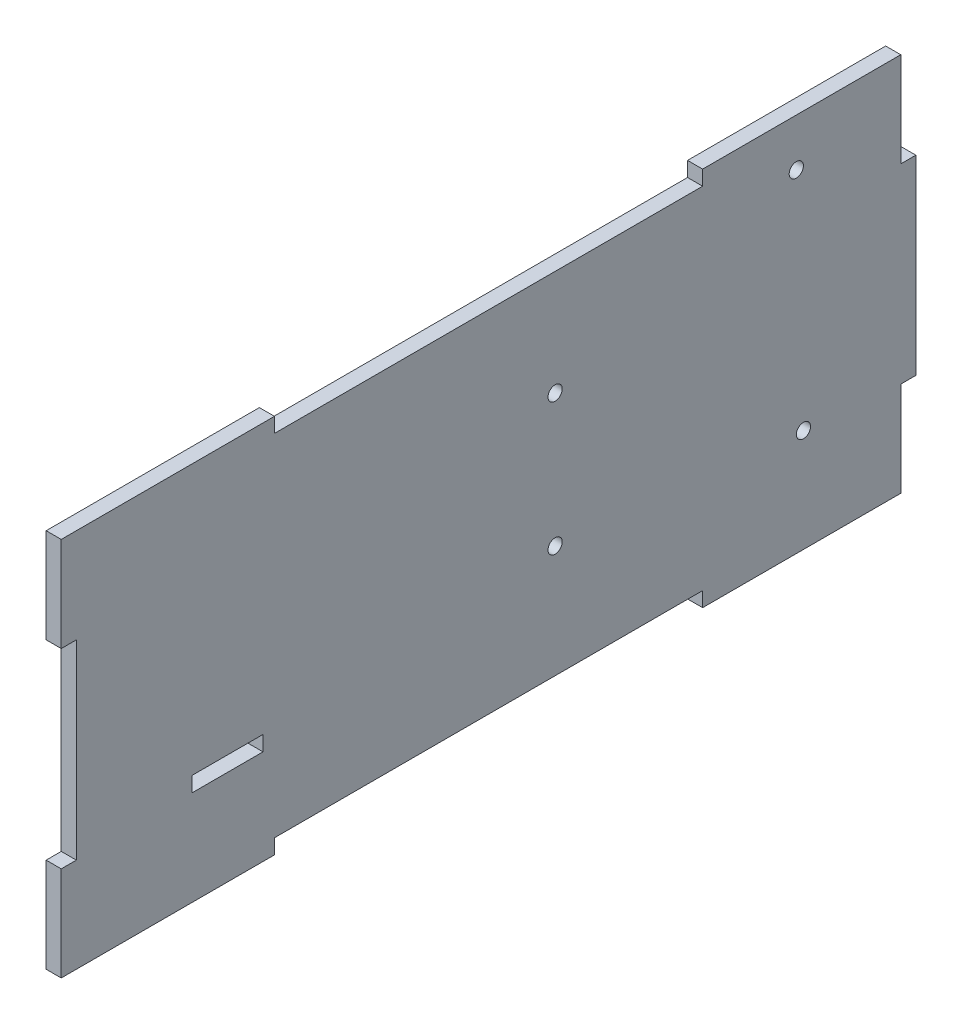
ISO-10303-21;
HEADER;
FILE_DESCRIPTION(('STEP AP214'),'2;1');
FILE_NAME('part.step','',(''),(''),'','','');
FILE_SCHEMA(('AUTOMOTIVE_DESIGN { 1 0 10303 214 1 1 1 1 }'));
ENDSEC;
DATA;
#1=APPLICATION_CONTEXT('core data for automotive mechanical design processes');
#2=APPLICATION_PROTOCOL_DEFINITION('international standard','automotive_design',2000,#1);
#3=PRODUCT_CONTEXT('',#1,'mechanical');
#4=PRODUCT('Part','Part','',(#3));
#5=PRODUCT_RELATED_PRODUCT_CATEGORY('part','',(#4));
#6=PRODUCT_DEFINITION_FORMATION('','',#4);
#7=PRODUCT_DEFINITION_CONTEXT('part definition',#1,'design');
#8=PRODUCT_DEFINITION('design','',#6,#7);
#9=PRODUCT_DEFINITION_SHAPE('','',#8);
#10=(LENGTH_UNIT() NAMED_UNIT(*) SI_UNIT(.MILLI.,.METRE.));
#11=(NAMED_UNIT(*) PLANE_ANGLE_UNIT() SI_UNIT($,.RADIAN.));
#12=(NAMED_UNIT(*) SI_UNIT($,.STERADIAN.) SOLID_ANGLE_UNIT());
#13=UNCERTAINTY_MEASURE_WITH_UNIT(LENGTH_MEASURE(1.E-05),#10,'distance_accuracy_value','');
#14=(GEOMETRIC_REPRESENTATION_CONTEXT(3) GLOBAL_UNCERTAINTY_ASSIGNED_CONTEXT((#13)) GLOBAL_UNIT_ASSIGNED_CONTEXT((#10,
#11,#12)) REPRESENTATION_CONTEXT('',''));
#15=CARTESIAN_POINT('',(0.,0.,0.));
#16=DIRECTION('',(0.,0.,1.));
#17=DIRECTION('',(1.,0.,0.));
#18=AXIS2_PLACEMENT_3D('',#15,#16,#17);
#19=CARTESIAN_POINT('',(3.18,-40.,-90.));
#20=DIRECTION('',(0.,1.,0.));
#21=DIRECTION('',(0.,0.,1.));
#22=AXIS2_PLACEMENT_3D('',#19,#20,#21);
#23=PLANE('',#22);
#24=DIRECTION('',(1.,0.,0.));
#25=VECTOR('',#24,1.);
#26=CARTESIAN_POINT('',(-20.162353533256,-40.,-86.82));
#27=LINE('',#26,#25);
#28=CARTESIAN_POINT('',(0.,-40.,-86.82));
#29=VERTEX_POINT('',#28);
#30=CARTESIAN_POINT('',(3.18,-40.,-86.82));
#31=VERTEX_POINT('',#30);
#32=EDGE_CURVE('E270',#29,#31,#27,.T.);
#33=ORIENTED_EDGE('',*,*,#32,.T.);
#34=DIRECTION('',(0.,0.,-1.));
#35=VECTOR('',#34,1.);
#36=CARTESIAN_POINT('',(3.18,-40.,-90.));
#37=LINE('',#36,#35);
#38=CARTESIAN_POINT('',(3.18,-40.,-45.09));
#39=VERTEX_POINT('',#38);
#40=EDGE_CURVE('E374',#39,#31,#37,.T.);
#41=ORIENTED_EDGE('',*,*,#40,.F.);
#42=DIRECTION('',(1.,0.,0.));
#43=VECTOR('',#42,1.);
#44=CARTESIAN_POINT('',(-90.2339559146112,-40.,-45.09));
#45=LINE('',#44,#43);
#46=CARTESIAN_POINT('',(0.,-40.,-45.09));
#47=VERTEX_POINT('',#46);
#48=EDGE_CURVE('E318',#47,#39,#45,.T.);
#49=ORIENTED_EDGE('',*,*,#48,.F.);
#50=DIRECTION('',(0.,0.,-1.));
#51=VECTOR('',#50,1.);
#52=CARTESIAN_POINT('',(0.,-40.,-90.));
#53=LINE('',#52,#51);
#54=EDGE_CURVE('E387',#47,#29,#53,.T.);
#55=ORIENTED_EDGE('',*,*,#54,.T.);
#56=EDGE_LOOP('',(#33,#41,#49,#55));
#57=FACE_BOUND('',#56,.T.);
#58=ADVANCED_FACE('F37',(#57),#23,.F.);
#59=CARTESIAN_POINT('',(3.18,0.,0.));
#60=DIRECTION('',(1.,0.,0.));
#61=DIRECTION('',(0.,0.,-1.));
#62=AXIS2_PLACEMENT_3D('',#59,#60,#61);
#63=PLANE('',#62);
#64=DIRECTION('',(0.,1.,0.));
#65=VECTOR('',#64,1.);
#66=CARTESIAN_POINT('',(3.18,-16.82,62.5));
#67=LINE('',#66,#65);
#68=CARTESIAN_POINT('',(3.18,-20.,62.5));
#69=VERTEX_POINT('',#68);
#70=CARTESIAN_POINT('',(3.18,-16.82,62.5));
#71=VERTEX_POINT('',#70);
#72=EDGE_CURVE('E200',#69,#71,#67,.T.);
#73=ORIENTED_EDGE('',*,*,#72,.T.);
#74=DIRECTION('',(0.,0.,-1.));
#75=VECTOR('',#74,1.);
#76=CARTESIAN_POINT('',(3.18,-16.82,62.5));
#77=LINE('',#76,#75);
#78=CARTESIAN_POINT('',(3.18,-16.82,47.5));
#79=VERTEX_POINT('',#78);
#80=EDGE_CURVE('E209',#71,#79,#77,.T.);
#81=ORIENTED_EDGE('',*,*,#80,.T.);
#82=DIRECTION('',(0.,-1.,0.));
#83=VECTOR('',#82,1.);
#84=CARTESIAN_POINT('',(3.18,-16.82,47.5));
#85=LINE('',#84,#83);
#86=CARTESIAN_POINT('',(3.18,-20.,47.5));
#87=VERTEX_POINT('',#86);
#88=EDGE_CURVE('E52',#79,#87,#85,.T.);
#89=ORIENTED_EDGE('',*,*,#88,.T.);
#90=DIRECTION('',(0.,0.,1.));
#91=VECTOR('',#90,1.);
#92=CARTESIAN_POINT('',(3.18,-20.,62.5));
#93=LINE('',#92,#91);
#94=EDGE_CURVE('E206',#87,#69,#93,.T.);
#95=ORIENTED_EDGE('',*,*,#94,.T.);
#96=EDGE_LOOP('',(#73,#81,#89,#95));
#97=FACE_BOUND('',#96,.T.);
#98=CARTESIAN_POINT('',(3.18,30.,-64.82));
#99=DIRECTION('',(1.,0.,0.));
#100=DIRECTION('',(0.,0.,-1.));
#101=AXIS2_PLACEMENT_3D('',#98,#99,#100);
#102=CIRCLE('',#101,1.5);
#103=CARTESIAN_POINT('',(3.18,30.,-66.32));
#104=VERTEX_POINT('',#103);
#105=EDGE_CURVE('E235',#104,#104,#102,.T.);
#106=ORIENTED_EDGE('',*,*,#105,.F.);
#107=EDGE_LOOP('',(#106));
#108=FACE_BOUND('',#107,.T.);
#109=CARTESIAN_POINT('',(3.18,14.7,-14.02));
#110=DIRECTION('',(1.,0.,0.));
#111=DIRECTION('',(0.,0.,-1.));
#112=AXIS2_PLACEMENT_3D('',#109,#110,#111);
#113=CIRCLE('',#112,1.49999999999997);
#114=CARTESIAN_POINT('',(3.18,14.7,-15.52));
#115=VERTEX_POINT('',#114);
#116=EDGE_CURVE('E243',#115,#115,#113,.T.);
#117=ORIENTED_EDGE('',*,*,#116,.F.);
#118=EDGE_LOOP('',(#117));
#119=FACE_BOUND('',#118,.T.);
#120=CARTESIAN_POINT('',(3.18,-13.2,-14.02));
#121=DIRECTION('',(1.,0.,0.));
#122=DIRECTION('',(0.,0.,-1.));
#123=AXIS2_PLACEMENT_3D('',#120,#121,#122);
#124=CIRCLE('',#123,1.49999999999997);
#125=CARTESIAN_POINT('',(3.18,-13.2,-15.52));
#126=VERTEX_POINT('',#125);
#127=EDGE_CURVE('E249',#126,#126,#124,.T.);
#128=ORIENTED_EDGE('',*,*,#127,.F.);
#129=EDGE_LOOP('',(#128));
#130=FACE_BOUND('',#129,.T.);
#131=CARTESIAN_POINT('',(3.18,-18.3,-66.32));
#132=DIRECTION('',(1.,0.,0.));
#133=DIRECTION('',(0.,0.,-1.));
#134=AXIS2_PLACEMENT_3D('',#131,#132,#133);
#135=CIRCLE('',#134,1.49999999999998);
#136=CARTESIAN_POINT('',(3.18,-18.3,-67.82));
#137=VERTEX_POINT('',#136);
#138=EDGE_CURVE('E231',#137,#137,#135,.T.);
#139=ORIENTED_EDGE('',*,*,#138,.F.);
#140=EDGE_LOOP('',(#139));
#141=FACE_BOUND('',#140,.T.);
#142=DIRECTION('',(0.,1.,0.));
#143=VECTOR('',#142,1.);
#144=CARTESIAN_POINT('',(3.18,-40.,-86.82));
#145=LINE('',#144,#143);
#146=CARTESIAN_POINT('',(3.18,-20.09,-86.82));
#147=VERTEX_POINT('',#146);
#148=EDGE_CURVE('E266',#31,#147,#145,.T.);
#149=ORIENTED_EDGE('',*,*,#148,.T.);
#150=DIRECTION('',(0.,0.,-1.));
#151=VECTOR('',#150,1.);
#152=CARTESIAN_POINT('',(3.18,-20.09,-90.));
#153=LINE('',#152,#151);
#154=CARTESIAN_POINT('',(3.18,-20.09,-90.));
#155=VERTEX_POINT('',#154);
#156=EDGE_CURVE('E242',#147,#155,#153,.T.);
#157=ORIENTED_EDGE('',*,*,#156,.T.);
#158=DIRECTION('',(0.,1.,0.));
#159=VECTOR('',#158,1.);
#160=CARTESIAN_POINT('',(3.18,-40.,-90.));
#161=LINE('',#160,#159);
#162=CARTESIAN_POINT('',(3.18,20.09,-90.));
#163=VERTEX_POINT('',#162);
#164=EDGE_CURVE('E379',#155,#163,#161,.T.);
#165=ORIENTED_EDGE('',*,*,#164,.T.);
#166=DIRECTION('',(0.,0.,-1.));
#167=VECTOR('',#166,1.);
#168=CARTESIAN_POINT('',(3.18,20.09,-90.));
#169=LINE('',#168,#167);
#170=CARTESIAN_POINT('',(3.18,20.09,-86.82));
#171=VERTEX_POINT('',#170);
#172=EDGE_CURVE('E286',#171,#163,#169,.T.);
#173=ORIENTED_EDGE('',*,*,#172,.F.);
#174=DIRECTION('',(0.,-1.,0.));
#175=VECTOR('',#174,1.);
#176=CARTESIAN_POINT('',(3.18,40.,-86.82));
#177=LINE('',#176,#175);
#178=CARTESIAN_POINT('',(3.18,40.,-86.82));
#179=VERTEX_POINT('',#178);
#180=EDGE_CURVE('E262',#179,#171,#177,.T.);
#181=ORIENTED_EDGE('',*,*,#180,.F.);
#182=DIRECTION('',(0.,0.,1.));
#183=VECTOR('',#182,1.);
#184=CARTESIAN_POINT('',(3.18,40.,-90.));
#185=LINE('',#184,#183);
#186=CARTESIAN_POINT('',(3.18,40.,-45.09));
#187=VERTEX_POINT('',#186);
#188=EDGE_CURVE('E382',#179,#187,#185,.T.);
#189=ORIENTED_EDGE('',*,*,#188,.T.);
#190=DIRECTION('',(0.,1.,0.));
#191=VECTOR('',#190,1.);
#192=CARTESIAN_POINT('',(3.18,40.,-45.09));
#193=LINE('',#192,#191);
#194=CARTESIAN_POINT('',(3.18,36.88,-45.09));
#195=VERTEX_POINT('',#194);
#196=EDGE_CURVE('E334',#195,#187,#193,.T.);
#197=ORIENTED_EDGE('',*,*,#196,.F.);
#198=DIRECTION('',(0.,0.,-1.));
#199=VECTOR('',#198,1.);
#200=CARTESIAN_POINT('',(3.18,36.88,45.09));
#201=LINE('',#200,#199);
#202=CARTESIAN_POINT('',(3.18,36.88,45.09));
#203=VERTEX_POINT('',#202);
#204=EDGE_CURVE('E331',#203,#195,#201,.T.);
#205=ORIENTED_EDGE('',*,*,#204,.F.);
#206=DIRECTION('',(0.,-1.,0.));
#207=VECTOR('',#206,1.);
#208=CARTESIAN_POINT('',(3.18,40.,45.09));
#209=LINE('',#208,#207);
#210=CARTESIAN_POINT('',(3.18,40.,45.09));
#211=VERTEX_POINT('',#210);
#212=EDGE_CURVE('E305',#211,#203,#209,.T.);
#213=ORIENTED_EDGE('',*,*,#212,.F.);
#214=CARTESIAN_POINT('',(3.18,40.,90.));
#215=VERTEX_POINT('',#214);
#216=EDGE_CURVE('E381',#211,#215,#185,.T.);
#217=ORIENTED_EDGE('',*,*,#216,.T.);
#218=DIRECTION('',(0.,-1.,0.));
#219=VECTOR('',#218,1.);
#220=CARTESIAN_POINT('',(3.18,-40.,90.));
#221=LINE('',#220,#219);
#222=CARTESIAN_POINT('',(3.18,20.09,90.));
#223=VERTEX_POINT('',#222);
#224=EDGE_CURVE('E371',#215,#223,#221,.T.);
#225=ORIENTED_EDGE('',*,*,#224,.T.);
#226=DIRECTION('',(0.,0.,1.));
#227=VECTOR('',#226,1.);
#228=CARTESIAN_POINT('',(3.18,20.09,90.));
#229=LINE('',#228,#227);
#230=CARTESIAN_POINT('',(3.18,20.09,86.82));
#231=VERTEX_POINT('',#230);
#232=EDGE_CURVE('E359',#231,#223,#229,.T.);
#233=ORIENTED_EDGE('',*,*,#232,.F.);
#234=DIRECTION('',(0.,1.,0.));
#235=VECTOR('',#234,1.);
#236=CARTESIAN_POINT('',(3.18,-20.09,86.82));
#237=LINE('',#236,#235);
#238=CARTESIAN_POINT('',(3.18,-20.09,86.82));
#239=VERTEX_POINT('',#238);
#240=EDGE_CURVE('E356',#239,#231,#237,.T.);
#241=ORIENTED_EDGE('',*,*,#240,.F.);
#242=DIRECTION('',(0.,0.,-1.));
#243=VECTOR('',#242,1.);
#244=CARTESIAN_POINT('',(3.18,-20.09,90.));
#245=LINE('',#244,#243);
#246=CARTESIAN_POINT('',(3.18,-20.09,90.));
#247=VERTEX_POINT('',#246);
#248=EDGE_CURVE('E346',#247,#239,#245,.T.);
#249=ORIENTED_EDGE('',*,*,#248,.F.);
#250=CARTESIAN_POINT('',(3.18,-40.,90.));
#251=VERTEX_POINT('',#250);
#252=EDGE_CURVE('E375',#247,#251,#221,.T.);
#253=ORIENTED_EDGE('',*,*,#252,.T.);
#254=CARTESIAN_POINT('',(3.18,-40.,45.09));
#255=VERTEX_POINT('',#254);
#256=EDGE_CURVE('E376',#251,#255,#37,.T.);
#257=ORIENTED_EDGE('',*,*,#256,.T.);
#258=DIRECTION('',(0.,1.,0.));
#259=VECTOR('',#258,1.);
#260=CARTESIAN_POINT('',(3.18,-40.,45.09));
#261=LINE('',#260,#259);
#262=CARTESIAN_POINT('',(3.18,-36.88,45.09));
#263=VERTEX_POINT('',#262);
#264=EDGE_CURVE('E283',#255,#263,#261,.T.);
#265=ORIENTED_EDGE('',*,*,#264,.T.);
#266=DIRECTION('',(0.,0.,-1.));
#267=VECTOR('',#266,1.);
#268=CARTESIAN_POINT('',(3.18,-36.88,45.09));
#269=LINE('',#268,#267);
#270=CARTESIAN_POINT('',(3.18,-36.88,-45.09));
#271=VERTEX_POINT('',#270);
#272=EDGE_CURVE('E311',#263,#271,#269,.T.);
#273=ORIENTED_EDGE('',*,*,#272,.T.);
#274=DIRECTION('',(0.,-1.,0.));
#275=VECTOR('',#274,1.);
#276=CARTESIAN_POINT('',(3.18,-40.,-45.09));
#277=LINE('',#276,#275);
#278=EDGE_CURVE('E308',#271,#39,#277,.T.);
#279=ORIENTED_EDGE('',*,*,#278,.T.);
#280=ORIENTED_EDGE('',*,*,#40,.T.);
#281=EDGE_LOOP('',(#149,#157,#165,#173,#181,#189,#197,#205,#213,#217,#225,#233,#241,#249,#253,
#257,#265,#273,#279,#280));
#282=FACE_BOUND('',#281,.T.);
#283=ADVANCED_FACE('F213',(#97,#108,#119,#130,#141,#282),#63,.T.);
#284=CARTESIAN_POINT('',(0.,0.,0.));
#285=DIRECTION('',(1.,0.,0.));
#286=DIRECTION('',(0.,0.,-1.));
#287=AXIS2_PLACEMENT_3D('',#284,#285,#286);
#288=PLANE('',#287);
#289=DIRECTION('',(0.,0.,-1.));
#290=VECTOR('',#289,1.);
#291=CARTESIAN_POINT('',(0.,-16.82,62.5));
#292=LINE('',#291,#290);
#293=CARTESIAN_POINT('',(0.,-16.82,62.5));
#294=VERTEX_POINT('',#293);
#295=CARTESIAN_POINT('',(0.,-16.82,47.5));
#296=VERTEX_POINT('',#295);
#297=EDGE_CURVE('E225',#294,#296,#292,.T.);
#298=ORIENTED_EDGE('',*,*,#297,.F.);
#299=DIRECTION('',(0.,1.,0.));
#300=VECTOR('',#299,1.);
#301=CARTESIAN_POINT('',(0.,-16.82,62.5));
#302=LINE('',#301,#300);
#303=CARTESIAN_POINT('',(0.,-20.,62.5));
#304=VERTEX_POINT('',#303);
#305=EDGE_CURVE('E60',#304,#294,#302,.T.);
#306=ORIENTED_EDGE('',*,*,#305,.F.);
#307=DIRECTION('',(0.,0.,1.));
#308=VECTOR('',#307,1.);
#309=CARTESIAN_POINT('',(0.,-20.,62.5));
#310=LINE('',#309,#308);
#311=CARTESIAN_POINT('',(0.,-20.,47.5));
#312=VERTEX_POINT('',#311);
#313=EDGE_CURVE('E216',#312,#304,#310,.T.);
#314=ORIENTED_EDGE('',*,*,#313,.F.);
#315=DIRECTION('',(0.,-1.,0.));
#316=VECTOR('',#315,1.);
#317=CARTESIAN_POINT('',(0.,-16.82,47.5));
#318=LINE('',#317,#316);
#319=EDGE_CURVE('E219',#296,#312,#318,.T.);
#320=ORIENTED_EDGE('',*,*,#319,.F.);
#321=EDGE_LOOP('',(#298,#306,#314,#320));
#322=FACE_BOUND('',#321,.T.);
#323=CARTESIAN_POINT('',(0.,30.,-64.82));
#324=DIRECTION('',(1.,0.,0.));
#325=DIRECTION('',(0.,0.,-1.));
#326=AXIS2_PLACEMENT_3D('',#323,#324,#325);
#327=CIRCLE('',#326,1.5);
#328=CARTESIAN_POINT('',(0.,30.,-66.32));
#329=VERTEX_POINT('',#328);
#330=EDGE_CURVE('E238',#329,#329,#327,.F.);
#331=ORIENTED_EDGE('',*,*,#330,.F.);
#332=EDGE_LOOP('',(#331));
#333=FACE_BOUND('',#332,.T.);
#334=CARTESIAN_POINT('',(0.,14.7,-14.02));
#335=DIRECTION('',(1.,0.,0.));
#336=DIRECTION('',(0.,0.,-1.));
#337=AXIS2_PLACEMENT_3D('',#334,#335,#336);
#338=CIRCLE('',#337,1.49999999999997);
#339=CARTESIAN_POINT('',(0.,14.7,-15.52));
#340=VERTEX_POINT('',#339);
#341=EDGE_CURVE('E239',#340,#340,#338,.F.);
#342=ORIENTED_EDGE('',*,*,#341,.F.);
#343=EDGE_LOOP('',(#342));
#344=FACE_BOUND('',#343,.T.);
#345=CARTESIAN_POINT('',(0.,-13.2,-14.02));
#346=DIRECTION('',(1.,0.,0.));
#347=DIRECTION('',(0.,0.,-1.));
#348=AXIS2_PLACEMENT_3D('',#345,#346,#347);
#349=CIRCLE('',#348,1.49999999999997);
#350=CARTESIAN_POINT('',(0.,-13.2,-15.52));
#351=VERTEX_POINT('',#350);
#352=EDGE_CURVE('E246',#351,#351,#349,.F.);
#353=ORIENTED_EDGE('',*,*,#352,.F.);
#354=EDGE_LOOP('',(#353));
#355=FACE_BOUND('',#354,.T.);
#356=CARTESIAN_POINT('',(0.,-18.3,-66.32));
#357=DIRECTION('',(1.,0.,0.));
#358=DIRECTION('',(0.,0.,-1.));
#359=AXIS2_PLACEMENT_3D('',#356,#357,#358);
#360=CIRCLE('',#359,1.49999999999998);
#361=CARTESIAN_POINT('',(0.,-18.3,-67.82));
#362=VERTEX_POINT('',#361);
#363=EDGE_CURVE('E252',#362,#362,#360,.F.);
#364=ORIENTED_EDGE('',*,*,#363,.F.);
#365=EDGE_LOOP('',(#364));
#366=FACE_BOUND('',#365,.T.);
#367=DIRECTION('',(0.,0.,1.));
#368=VECTOR('',#367,1.);
#369=CARTESIAN_POINT('',(0.,-20.09,-90.));
#370=LINE('',#369,#368);
#371=CARTESIAN_POINT('',(0.,-20.09,-90.));
#372=VERTEX_POINT('',#371);
#373=CARTESIAN_POINT('',(0.,-20.09,-86.82));
#374=VERTEX_POINT('',#373);
#375=EDGE_CURVE('E263',#372,#374,#370,.T.);
#376=ORIENTED_EDGE('',*,*,#375,.T.);
#377=DIRECTION('',(0.,-1.,0.));
#378=VECTOR('',#377,1.);
#379=CARTESIAN_POINT('',(0.,-40.,-86.82));
#380=LINE('',#379,#378);
#381=EDGE_CURVE('E259',#374,#29,#380,.T.);
#382=ORIENTED_EDGE('',*,*,#381,.T.);
#383=ORIENTED_EDGE('',*,*,#54,.F.);
#384=DIRECTION('',(0.,1.,0.));
#385=VECTOR('',#384,1.);
#386=CARTESIAN_POINT('',(0.,-40.,-45.09));
#387=LINE('',#386,#385);
#388=CARTESIAN_POINT('',(0.,-36.88,-45.09));
#389=VERTEX_POINT('',#388);
#390=EDGE_CURVE('E295',#47,#389,#387,.T.);
#391=ORIENTED_EDGE('',*,*,#390,.T.);
#392=DIRECTION('',(0.,0.,1.));
#393=VECTOR('',#392,1.);
#394=CARTESIAN_POINT('',(0.,-36.88,45.09));
#395=LINE('',#394,#393);
#396=CARTESIAN_POINT('',(0.,-36.88,45.09));
#397=VERTEX_POINT('',#396);
#398=EDGE_CURVE('E298',#389,#397,#395,.T.);
#399=ORIENTED_EDGE('',*,*,#398,.T.);
#400=DIRECTION('',(0.,-1.,0.));
#401=VECTOR('',#400,1.);
#402=CARTESIAN_POINT('',(0.,-40.,45.09));
#403=LINE('',#402,#401);
#404=CARTESIAN_POINT('',(0.,-40.,45.0899999999999));
#405=VERTEX_POINT('',#404);
#406=EDGE_CURVE('E302',#397,#405,#403,.T.);
#407=ORIENTED_EDGE('',*,*,#406,.T.);
#408=CARTESIAN_POINT('',(0.,-40.,90.));
#409=VERTEX_POINT('',#408);
#410=EDGE_CURVE('E388',#409,#405,#53,.T.);
#411=ORIENTED_EDGE('',*,*,#410,.F.);
#412=DIRECTION('',(0.,-1.,0.));
#413=VECTOR('',#412,1.);
#414=CARTESIAN_POINT('',(0.,-40.,90.));
#415=LINE('',#414,#413);
#416=CARTESIAN_POINT('',(0.,-20.09,90.));
#417=VERTEX_POINT('',#416);
#418=EDGE_CURVE('E370',#417,#409,#415,.T.);
#419=ORIENTED_EDGE('',*,*,#418,.F.);
#420=DIRECTION('',(0.,0.,1.));
#421=VECTOR('',#420,1.);
#422=CARTESIAN_POINT('',(0.,-20.09,90.));
#423=LINE('',#422,#421);
#424=CARTESIAN_POINT('',(0.,-20.09,86.82));
#425=VERTEX_POINT('',#424);
#426=EDGE_CURVE('E353',#425,#417,#423,.T.);
#427=ORIENTED_EDGE('',*,*,#426,.F.);
#428=DIRECTION('',(0.,-1.,0.));
#429=VECTOR('',#428,1.);
#430=CARTESIAN_POINT('',(0.,-20.09,86.82));
#431=LINE('',#430,#429);
#432=CARTESIAN_POINT('',(0.,20.09,86.82));
#433=VERTEX_POINT('',#432);
#434=EDGE_CURVE('E347',#433,#425,#431,.T.);
#435=ORIENTED_EDGE('',*,*,#434,.F.);
#436=DIRECTION('',(0.,0.,-1.));
#437=VECTOR('',#436,1.);
#438=CARTESIAN_POINT('',(0.,20.09,90.));
#439=LINE('',#438,#437);
#440=CARTESIAN_POINT('',(0.,20.09,90.));
#441=VERTEX_POINT('',#440);
#442=EDGE_CURVE('E350',#441,#433,#439,.T.);
#443=ORIENTED_EDGE('',*,*,#442,.F.);
#444=CARTESIAN_POINT('',(0.,40.,90.));
#445=VERTEX_POINT('',#444);
#446=EDGE_CURVE('E384',#445,#441,#415,.T.);
#447=ORIENTED_EDGE('',*,*,#446,.F.);
#448=DIRECTION('',(0.,0.,1.));
#449=VECTOR('',#448,1.);
#450=CARTESIAN_POINT('',(0.,40.,-90.));
#451=LINE('',#450,#449);
#452=CARTESIAN_POINT('',(0.,40.,45.09));
#453=VERTEX_POINT('',#452);
#454=EDGE_CURVE('E393',#453,#445,#451,.T.);
#455=ORIENTED_EDGE('',*,*,#454,.F.);
#456=DIRECTION('',(0.,1.,0.));
#457=VECTOR('',#456,1.);
#458=CARTESIAN_POINT('',(0.,40.,45.09));
#459=LINE('',#458,#457);
#460=CARTESIAN_POINT('',(0.,36.88,45.09));
#461=VERTEX_POINT('',#460);
#462=EDGE_CURVE('E325',#461,#453,#459,.T.);
#463=ORIENTED_EDGE('',*,*,#462,.F.);
#464=DIRECTION('',(0.,0.,1.));
#465=VECTOR('',#464,1.);
#466=CARTESIAN_POINT('',(0.,36.88,45.09));
#467=LINE('',#466,#465);
#468=CARTESIAN_POINT('',(0.,36.88,-45.09));
#469=VERTEX_POINT('',#468);
#470=EDGE_CURVE('E328',#469,#461,#467,.T.);
#471=ORIENTED_EDGE('',*,*,#470,.F.);
#472=DIRECTION('',(0.,-1.,0.));
#473=VECTOR('',#472,1.);
#474=CARTESIAN_POINT('',(0.,40.,-45.09));
#475=LINE('',#474,#473);
#476=CARTESIAN_POINT('',(0.,40.,-45.09));
#477=VERTEX_POINT('',#476);
#478=EDGE_CURVE('E322',#477,#469,#475,.T.);
#479=ORIENTED_EDGE('',*,*,#478,.F.);
#480=CARTESIAN_POINT('',(0.,40.,-86.82));
#481=VERTEX_POINT('',#480);
#482=EDGE_CURVE('E394',#481,#477,#451,.T.);
#483=ORIENTED_EDGE('',*,*,#482,.F.);
#484=DIRECTION('',(0.,1.,0.));
#485=VECTOR('',#484,1.);
#486=CARTESIAN_POINT('',(0.,40.,-86.82));
#487=LINE('',#486,#485);
#488=CARTESIAN_POINT('',(0.,20.09,-86.82));
#489=VERTEX_POINT('',#488);
#490=EDGE_CURVE('E278',#489,#481,#487,.T.);
#491=ORIENTED_EDGE('',*,*,#490,.F.);
#492=DIRECTION('',(0.,0.,1.));
#493=VECTOR('',#492,1.);
#494=CARTESIAN_POINT('',(0.,20.09,-90.));
#495=LINE('',#494,#493);
#496=CARTESIAN_POINT('',(0.,20.09,-90.));
#497=VERTEX_POINT('',#496);
#498=EDGE_CURVE('E280',#497,#489,#495,.T.);
#499=ORIENTED_EDGE('',*,*,#498,.F.);
#500=DIRECTION('',(0.,1.,0.));
#501=VECTOR('',#500,1.);
#502=CARTESIAN_POINT('',(0.,-40.,-90.));
#503=LINE('',#502,#501);
#504=EDGE_CURVE('E391',#372,#497,#503,.T.);
#505=ORIENTED_EDGE('',*,*,#504,.F.);
#506=EDGE_LOOP('',(#376,#382,#383,#391,#399,#407,#411,#419,#427,#435,#443,#447,#455,#463,#471,
#479,#483,#491,#499,#505));
#507=FACE_BOUND('',#506,.T.);
#508=ADVANCED_FACE('F406',(#322,#333,#344,#355,#366,#507),#288,.F.);
#509=CARTESIAN_POINT('',(3.18,-40.,-90.));
#510=DIRECTION('',(0.,0.,1.));
#511=DIRECTION('',(1.,0.,0.));
#512=AXIS2_PLACEMENT_3D('',#509,#510,#511);
#513=PLANE('',#512);
#514=DIRECTION('',(1.,0.,0.));
#515=VECTOR('',#514,1.);
#516=CARTESIAN_POINT('',(-20.162353533256,-20.09,-90.));
#517=LINE('',#516,#515);
#518=EDGE_CURVE('E269',#372,#155,#517,.T.);
#519=ORIENTED_EDGE('',*,*,#518,.F.);
#520=ORIENTED_EDGE('',*,*,#504,.T.);
#521=DIRECTION('',(1.,0.,0.));
#522=VECTOR('',#521,1.);
#523=CARTESIAN_POINT('',(-20.162353533256,20.09,-90.));
#524=LINE('',#523,#522);
#525=EDGE_CURVE('E281',#497,#163,#524,.T.);
#526=ORIENTED_EDGE('',*,*,#525,.T.);
#527=ORIENTED_EDGE('',*,*,#164,.F.);
#528=EDGE_LOOP('',(#519,#520,#526,#527));
#529=FACE_BOUND('',#528,.T.);
#530=ADVANCED_FACE('F453',(#529),#513,.F.);
#531=DIRECTION('',(1.,0.,0.));
#532=VECTOR('',#531,1.);
#533=CARTESIAN_POINT('',(-90.2339559146112,-40.,45.09));
#534=LINE('',#533,#532);
#535=EDGE_CURVE('E314',#405,#255,#534,.T.);
#536=ORIENTED_EDGE('',*,*,#535,.T.);
#537=ORIENTED_EDGE('',*,*,#256,.F.);
#538=DIRECTION('',(-1.,0.,0.));
#539=VECTOR('',#538,1.);
#540=CARTESIAN_POINT('',(3.18,-40.,90.));
#541=LINE('',#540,#539);
#542=EDGE_CURVE('E11',#251,#409,#541,.T.);
#543=ORIENTED_EDGE('',*,*,#542,.T.);
#544=ORIENTED_EDGE('',*,*,#410,.T.);
#545=EDGE_LOOP('',(#536,#537,#543,#544));
#546=FACE_BOUND('',#545,.T.);
#547=ADVANCED_FACE('F479',(#546),#23,.F.);
#548=CARTESIAN_POINT('',(3.18,40.,-90.));
#549=DIRECTION('',(0.,-1.,0.));
#550=DIRECTION('',(0.,0.,-1.));
#551=AXIS2_PLACEMENT_3D('',#548,#549,#550);
#552=PLANE('',#551);
#553=ORIENTED_EDGE('',*,*,#216,.F.);
#554=DIRECTION('',(1.,0.,0.));
#555=VECTOR('',#554,1.);
#556=CARTESIAN_POINT('',(-90.2339559146112,40.,45.09));
#557=LINE('',#556,#555);
#558=EDGE_CURVE('E326',#453,#211,#557,.T.);
#559=ORIENTED_EDGE('',*,*,#558,.F.);
#560=ORIENTED_EDGE('',*,*,#454,.T.);
#561=DIRECTION('',(-1.,0.,0.));
#562=VECTOR('',#561,1.);
#563=CARTESIAN_POINT('',(3.18,40.,90.));
#564=LINE('',#563,#562);
#565=EDGE_CURVE('E45',#215,#445,#564,.T.);
#566=ORIENTED_EDGE('',*,*,#565,.F.);
#567=EDGE_LOOP('',(#553,#559,#560,#566));
#568=FACE_BOUND('',#567,.T.);
#569=ADVANCED_FACE('F422',(#568),#552,.F.);
#570=CARTESIAN_POINT('',(3.18,-40.,90.));
#571=DIRECTION('',(0.,0.,-1.));
#572=DIRECTION('',(-1.,0.,0.));
#573=AXIS2_PLACEMENT_3D('',#570,#571,#572);
#574=PLANE('',#573);
#575=ORIENTED_EDGE('',*,*,#446,.T.);
#576=DIRECTION('',(1.,0.,0.));
#577=VECTOR('',#576,1.);
#578=CARTESIAN_POINT('',(-40.3056422849209,20.09,90.));
#579=LINE('',#578,#577);
#580=EDGE_CURVE('E351',#441,#223,#579,.T.);
#581=ORIENTED_EDGE('',*,*,#580,.T.);
#582=ORIENTED_EDGE('',*,*,#224,.F.);
#583=ORIENTED_EDGE('',*,*,#565,.T.);
#584=EDGE_LOOP('',(#575,#581,#582,#583));
#585=FACE_BOUND('',#584,.T.);
#586=ADVANCED_FACE('F400',(#585),#574,.F.);
#587=ORIENTED_EDGE('',*,*,#252,.F.);
#588=DIRECTION('',(1.,0.,0.));
#589=VECTOR('',#588,1.);
#590=CARTESIAN_POINT('',(-40.3056422849209,-20.09,90.));
#591=LINE('',#590,#589);
#592=EDGE_CURVE('E361',#417,#247,#591,.T.);
#593=ORIENTED_EDGE('',*,*,#592,.F.);
#594=ORIENTED_EDGE('',*,*,#418,.T.);
#595=ORIENTED_EDGE('',*,*,#542,.F.);
#596=EDGE_LOOP('',(#587,#593,#594,#595));
#597=FACE_BOUND('',#596,.T.);
#598=ADVANCED_FACE('F39',(#597),#574,.F.);
#599=ORIENTED_EDGE('',*,*,#188,.F.);
#600=DIRECTION('',(1.,0.,0.));
#601=VECTOR('',#600,1.);
#602=CARTESIAN_POINT('',(-20.162353533256,40.,-86.82));
#603=LINE('',#602,#601);
#604=EDGE_CURVE('E289',#481,#179,#603,.T.);
#605=ORIENTED_EDGE('',*,*,#604,.F.);
#606=ORIENTED_EDGE('',*,*,#482,.T.);
#607=DIRECTION('',(1.,0.,0.));
#608=VECTOR('',#607,1.);
#609=CARTESIAN_POINT('',(-90.2339559146112,40.,-45.09));
#610=LINE('',#609,#608);
#611=EDGE_CURVE('E339',#477,#187,#610,.T.);
#612=ORIENTED_EDGE('',*,*,#611,.T.);
#613=EDGE_LOOP('',(#599,#605,#606,#612));
#614=FACE_BOUND('',#613,.T.);
#615=ADVANCED_FACE('F437',(#614),#552,.F.);
#616=CARTESIAN_POINT('',(-40.3056422849209,20.09,90.));
#617=DIRECTION('',(0.,1.,0.));
#618=DIRECTION('',(0.,0.,1.));
#619=AXIS2_PLACEMENT_3D('',#616,#617,#618);
#620=PLANE('',#619);
#621=ORIENTED_EDGE('',*,*,#442,.T.);
#622=DIRECTION('',(1.,0.,0.));
#623=VECTOR('',#622,1.);
#624=CARTESIAN_POINT('',(-40.3056422849209,20.09,86.82));
#625=LINE('',#624,#623);
#626=EDGE_CURVE('E364',#433,#231,#625,.T.);
#627=ORIENTED_EDGE('',*,*,#626,.T.);
#628=ORIENTED_EDGE('',*,*,#232,.T.);
#629=ORIENTED_EDGE('',*,*,#580,.F.);
#630=EDGE_LOOP('',(#621,#627,#628,#629));
#631=FACE_BOUND('',#630,.T.);
#632=ADVANCED_FACE('F412',(#631),#620,.F.);
#633=CARTESIAN_POINT('',(-40.3056422849209,-20.09,86.82));
#634=DIRECTION('',(0.,0.,-1.));
#635=DIRECTION('',(-1.,0.,0.));
#636=AXIS2_PLACEMENT_3D('',#633,#634,#635);
#637=PLANE('',#636);
#638=ORIENTED_EDGE('',*,*,#434,.T.);
#639=DIRECTION('',(1.,0.,0.));
#640=VECTOR('',#639,1.);
#641=CARTESIAN_POINT('',(-40.3056422849209,-20.09,86.82));
#642=LINE('',#641,#640);
#643=EDGE_CURVE('E366',#425,#239,#642,.T.);
#644=ORIENTED_EDGE('',*,*,#643,.T.);
#645=ORIENTED_EDGE('',*,*,#240,.T.);
#646=ORIENTED_EDGE('',*,*,#626,.F.);
#647=EDGE_LOOP('',(#638,#644,#645,#646));
#648=FACE_BOUND('',#647,.T.);
#649=ADVANCED_FACE('F414',(#648),#637,.F.);
#650=CARTESIAN_POINT('',(-40.3056422849209,-20.09,90.));
#651=DIRECTION('',(0.,-1.,0.));
#652=DIRECTION('',(0.,0.,-1.));
#653=AXIS2_PLACEMENT_3D('',#650,#651,#652);
#654=PLANE('',#653);
#655=ORIENTED_EDGE('',*,*,#426,.T.);
#656=ORIENTED_EDGE('',*,*,#592,.T.);
#657=ORIENTED_EDGE('',*,*,#248,.T.);
#658=ORIENTED_EDGE('',*,*,#643,.F.);
#659=EDGE_LOOP('',(#655,#656,#657,#658));
#660=FACE_BOUND('',#659,.T.);
#661=ADVANCED_FACE('F486',(#660),#654,.F.);
#662=CARTESIAN_POINT('',(-90.2339559146112,40.,45.09));
#663=DIRECTION('',(0.,0.,1.));
#664=DIRECTION('',(1.,0.,0.));
#665=AXIS2_PLACEMENT_3D('',#662,#663,#664);
#666=PLANE('',#665);
#667=ORIENTED_EDGE('',*,*,#462,.T.);
#668=ORIENTED_EDGE('',*,*,#558,.T.);
#669=ORIENTED_EDGE('',*,*,#212,.T.);
#670=DIRECTION('',(1.,0.,0.));
#671=VECTOR('',#670,1.);
#672=CARTESIAN_POINT('',(-90.2339559146112,36.88,45.09));
#673=LINE('',#672,#671);
#674=EDGE_CURVE('E337',#461,#203,#673,.T.);
#675=ORIENTED_EDGE('',*,*,#674,.F.);
#676=EDGE_LOOP('',(#667,#668,#669,#675));
#677=FACE_BOUND('',#676,.T.);
#678=ADVANCED_FACE('F424',(#677),#666,.F.);
#679=CARTESIAN_POINT('',(-90.2339559146112,40.,-45.09));
#680=DIRECTION('',(0.,0.,-1.));
#681=DIRECTION('',(-1.,0.,0.));
#682=AXIS2_PLACEMENT_3D('',#679,#680,#681);
#683=PLANE('',#682);
#684=ORIENTED_EDGE('',*,*,#478,.T.);
#685=DIRECTION('',(1.,0.,0.));
#686=VECTOR('',#685,1.);
#687=CARTESIAN_POINT('',(-90.2339559146112,36.88,-45.09));
#688=LINE('',#687,#686);
#689=EDGE_CURVE('E342',#469,#195,#688,.T.);
#690=ORIENTED_EDGE('',*,*,#689,.T.);
#691=ORIENTED_EDGE('',*,*,#196,.T.);
#692=ORIENTED_EDGE('',*,*,#611,.F.);
#693=EDGE_LOOP('',(#684,#690,#691,#692));
#694=FACE_BOUND('',#693,.T.);
#695=ADVANCED_FACE('F434',(#694),#683,.F.);
#696=CARTESIAN_POINT('',(-90.2339559146112,36.88,45.09));
#697=DIRECTION('',(0.,-1.,0.));
#698=DIRECTION('',(0.,0.,-1.));
#699=AXIS2_PLACEMENT_3D('',#696,#697,#698);
#700=PLANE('',#699);
#701=ORIENTED_EDGE('',*,*,#470,.T.);
#702=ORIENTED_EDGE('',*,*,#674,.T.);
#703=ORIENTED_EDGE('',*,*,#204,.T.);
#704=ORIENTED_EDGE('',*,*,#689,.F.);
#705=EDGE_LOOP('',(#701,#702,#703,#704));
#706=FACE_BOUND('',#705,.T.);
#707=ADVANCED_FACE('F430',(#706),#700,.F.);
#708=CARTESIAN_POINT('',(-90.2339559146112,-40.,-45.09));
#709=DIRECTION('',(0.,0.,1.));
#710=DIRECTION('',(1.,0.,0.));
#711=AXIS2_PLACEMENT_3D('',#708,#709,#710);
#712=PLANE('',#711);
#713=ORIENTED_EDGE('',*,*,#48,.T.);
#714=ORIENTED_EDGE('',*,*,#278,.F.);
#715=DIRECTION('',(1.,0.,0.));
#716=VECTOR('',#715,1.);
#717=CARTESIAN_POINT('',(-90.2339559146112,-36.88,-45.09));
#718=LINE('',#717,#716);
#719=EDGE_CURVE('E316',#389,#271,#718,.T.);
#720=ORIENTED_EDGE('',*,*,#719,.F.);
#721=ORIENTED_EDGE('',*,*,#390,.F.);
#722=EDGE_LOOP('',(#713,#714,#720,#721));
#723=FACE_BOUND('',#722,.T.);
#724=ADVANCED_FACE('F470',(#723),#712,.T.);
#725=CARTESIAN_POINT('',(-90.2339559146112,-36.88,45.09));
#726=DIRECTION('',(0.,-1.,0.));
#727=DIRECTION('',(0.,0.,-1.));
#728=AXIS2_PLACEMENT_3D('',#725,#726,#727);
#729=PLANE('',#728);
#730=ORIENTED_EDGE('',*,*,#719,.T.);
#731=ORIENTED_EDGE('',*,*,#272,.F.);
#732=DIRECTION('',(1.,0.,0.));
#733=VECTOR('',#732,1.);
#734=CARTESIAN_POINT('',(-90.2339559146112,-36.88,45.09));
#735=LINE('',#734,#733);
#736=EDGE_CURVE('E299',#397,#263,#735,.T.);
#737=ORIENTED_EDGE('',*,*,#736,.F.);
#738=ORIENTED_EDGE('',*,*,#398,.F.);
#739=EDGE_LOOP('',(#730,#731,#737,#738));
#740=FACE_BOUND('',#739,.T.);
#741=ADVANCED_FACE('F474',(#740),#729,.T.);
#742=CARTESIAN_POINT('',(-90.2339559146112,-40.,45.09));
#743=DIRECTION('',(0.,0.,-1.));
#744=DIRECTION('',(-1.,0.,0.));
#745=AXIS2_PLACEMENT_3D('',#742,#743,#744);
#746=PLANE('',#745);
#747=ORIENTED_EDGE('',*,*,#736,.T.);
#748=ORIENTED_EDGE('',*,*,#264,.F.);
#749=ORIENTED_EDGE('',*,*,#535,.F.);
#750=ORIENTED_EDGE('',*,*,#406,.F.);
#751=EDGE_LOOP('',(#747,#748,#749,#750));
#752=FACE_BOUND('',#751,.T.);
#753=ADVANCED_FACE('F476',(#752),#746,.T.);
#754=CARTESIAN_POINT('',(-20.162353533256,20.09,-90.));
#755=DIRECTION('',(0.,-1.,0.));
#756=DIRECTION('',(0.,0.,-1.));
#757=AXIS2_PLACEMENT_3D('',#754,#755,#756);
#758=PLANE('',#757);
#759=ORIENTED_EDGE('',*,*,#498,.T.);
#760=DIRECTION('',(1.,0.,0.));
#761=VECTOR('',#760,1.);
#762=CARTESIAN_POINT('',(-20.162353533256,20.09,-86.82));
#763=LINE('',#762,#761);
#764=EDGE_CURVE('E292',#489,#171,#763,.T.);
#765=ORIENTED_EDGE('',*,*,#764,.T.);
#766=ORIENTED_EDGE('',*,*,#172,.T.);
#767=ORIENTED_EDGE('',*,*,#525,.F.);
#768=EDGE_LOOP('',(#759,#765,#766,#767));
#769=FACE_BOUND('',#768,.T.);
#770=ADVANCED_FACE('F448',(#769),#758,.F.);
#771=CARTESIAN_POINT('',(-20.162353533256,40.,-86.82));
#772=DIRECTION('',(0.,0.,1.));
#773=DIRECTION('',(1.,0.,0.));
#774=AXIS2_PLACEMENT_3D('',#771,#772,#773);
#775=PLANE('',#774);
#776=ORIENTED_EDGE('',*,*,#490,.T.);
#777=ORIENTED_EDGE('',*,*,#604,.T.);
#778=ORIENTED_EDGE('',*,*,#180,.T.);
#779=ORIENTED_EDGE('',*,*,#764,.F.);
#780=EDGE_LOOP('',(#776,#777,#778,#779));
#781=FACE_BOUND('',#780,.T.);
#782=ADVANCED_FACE('F444',(#781),#775,.F.);
#783=CARTESIAN_POINT('',(-20.162353533256,-20.09,-90.));
#784=DIRECTION('',(0.,-1.,0.));
#785=DIRECTION('',(0.,0.,-1.));
#786=AXIS2_PLACEMENT_3D('',#783,#784,#785);
#787=PLANE('',#786);
#788=ORIENTED_EDGE('',*,*,#518,.T.);
#789=ORIENTED_EDGE('',*,*,#156,.F.);
#790=DIRECTION('',(1.,0.,0.));
#791=VECTOR('',#790,1.);
#792=CARTESIAN_POINT('',(-20.162353533256,-20.09,-86.82));
#793=LINE('',#792,#791);
#794=EDGE_CURVE('E273',#374,#147,#793,.T.);
#795=ORIENTED_EDGE('',*,*,#794,.F.);
#796=ORIENTED_EDGE('',*,*,#375,.F.);
#797=EDGE_LOOP('',(#788,#789,#795,#796));
#798=FACE_BOUND('',#797,.T.);
#799=ADVANCED_FACE('F458',(#798),#787,.T.);
#800=CARTESIAN_POINT('',(-20.162353533256,-40.,-86.82));
#801=DIRECTION('',(0.,0.,-1.));
#802=DIRECTION('',(-1.,0.,0.));
#803=AXIS2_PLACEMENT_3D('',#800,#801,#802);
#804=PLANE('',#803);
#805=ORIENTED_EDGE('',*,*,#794,.T.);
#806=ORIENTED_EDGE('',*,*,#148,.F.);
#807=ORIENTED_EDGE('',*,*,#32,.F.);
#808=ORIENTED_EDGE('',*,*,#381,.F.);
#809=EDGE_LOOP('',(#805,#806,#807,#808));
#810=FACE_BOUND('',#809,.T.);
#811=ADVANCED_FACE('F461',(#810),#804,.T.);
#812=CARTESIAN_POINT('',(-4.24264068711928,-18.3,-66.32));
#813=DIRECTION('',(1.,0.,0.));
#814=DIRECTION('',(0.,0.,-1.));
#815=AXIS2_PLACEMENT_3D('',#812,#813,#814);
#816=CYLINDRICAL_SURFACE('',#815,1.49999999999998);
#817=ORIENTED_EDGE('',*,*,#363,.T.);
#818=EDGE_LOOP('',(#817));
#819=FACE_BOUND('',#818,.T.);
#820=ORIENTED_EDGE('',*,*,#138,.T.);
#821=EDGE_LOOP('',(#820));
#822=FACE_BOUND('',#821,.T.);
#823=ADVANCED_FACE('F628',(#819,#822),#816,.F.);
#824=CARTESIAN_POINT('',(-4.24264068711928,-13.2,-14.02));
#825=DIRECTION('',(1.,0.,0.));
#826=DIRECTION('',(0.,0.,-1.));
#827=AXIS2_PLACEMENT_3D('',#824,#825,#826);
#828=CYLINDRICAL_SURFACE('',#827,1.49999999999997);
#829=ORIENTED_EDGE('',*,*,#352,.T.);
#830=EDGE_LOOP('',(#829));
#831=FACE_BOUND('',#830,.T.);
#832=ORIENTED_EDGE('',*,*,#127,.T.);
#833=EDGE_LOOP('',(#832));
#834=FACE_BOUND('',#833,.T.);
#835=ADVANCED_FACE('F637',(#831,#834),#828,.F.);
#836=CARTESIAN_POINT('',(-4.24264068711928,14.7,-14.02));
#837=DIRECTION('',(1.,0.,0.));
#838=DIRECTION('',(0.,0.,-1.));
#839=AXIS2_PLACEMENT_3D('',#836,#837,#838);
#840=CYLINDRICAL_SURFACE('',#839,1.49999999999997);
#841=ORIENTED_EDGE('',*,*,#341,.T.);
#842=EDGE_LOOP('',(#841));
#843=FACE_BOUND('',#842,.T.);
#844=ORIENTED_EDGE('',*,*,#116,.T.);
#845=EDGE_LOOP('',(#844));
#846=FACE_BOUND('',#845,.T.);
#847=ADVANCED_FACE('F647',(#843,#846),#840,.F.);
#848=CARTESIAN_POINT('',(-4.24264068711928,30.,-64.82));
#849=DIRECTION('',(1.,0.,0.));
#850=DIRECTION('',(0.,0.,-1.));
#851=AXIS2_PLACEMENT_3D('',#848,#849,#850);
#852=CYLINDRICAL_SURFACE('',#851,1.5);
#853=ORIENTED_EDGE('',*,*,#330,.T.);
#854=EDGE_LOOP('',(#853));
#855=FACE_BOUND('',#854,.T.);
#856=ORIENTED_EDGE('',*,*,#105,.T.);
#857=EDGE_LOOP('',(#856));
#858=FACE_BOUND('',#857,.T.);
#859=ADVANCED_FACE('F657',(#855,#858),#852,.F.);
#860=CARTESIAN_POINT('',(3.18,-16.82,62.5));
#861=DIRECTION('',(0.,0.,1.));
#862=DIRECTION('',(1.,0.,0.));
#863=AXIS2_PLACEMENT_3D('',#860,#861,#862);
#864=PLANE('',#863);
#865=ORIENTED_EDGE('',*,*,#305,.T.);
#866=DIRECTION('',(-1.,0.,0.));
#867=VECTOR('',#866,1.);
#868=CARTESIAN_POINT('',(3.18,-16.82,62.5));
#869=LINE('',#868,#867);
#870=EDGE_CURVE('E196',#71,#294,#869,.T.);
#871=ORIENTED_EDGE('',*,*,#870,.F.);
#872=ORIENTED_EDGE('',*,*,#72,.F.);
#873=DIRECTION('',(-1.,0.,0.));
#874=VECTOR('',#873,1.);
#875=CARTESIAN_POINT('',(3.18,-20.,62.5));
#876=LINE('',#875,#874);
#877=EDGE_CURVE('E229',#69,#304,#876,.T.);
#878=ORIENTED_EDGE('',*,*,#877,.T.);
#879=EDGE_LOOP('',(#865,#871,#872,#878));
#880=FACE_BOUND('',#879,.T.);
#881=ADVANCED_FACE('F198',(#880),#864,.F.);
#882=CARTESIAN_POINT('',(3.18,-20.,62.5));
#883=DIRECTION('',(0.,-1.,0.));
#884=DIRECTION('',(0.,0.,-1.));
#885=AXIS2_PLACEMENT_3D('',#882,#883,#884);
#886=PLANE('',#885);
#887=ORIENTED_EDGE('',*,*,#313,.T.);
#888=ORIENTED_EDGE('',*,*,#877,.F.);
#889=ORIENTED_EDGE('',*,*,#94,.F.);
#890=DIRECTION('',(-1.,0.,0.));
#891=VECTOR('',#890,1.);
#892=CARTESIAN_POINT('',(3.18,-20.,47.5));
#893=LINE('',#892,#891);
#894=EDGE_CURVE('E232',#87,#312,#893,.T.);
#895=ORIENTED_EDGE('',*,*,#894,.T.);
#896=EDGE_LOOP('',(#887,#888,#889,#895));
#897=FACE_BOUND('',#896,.T.);
#898=ADVANCED_FACE('F686',(#897),#886,.F.);
#899=CARTESIAN_POINT('',(3.18,-16.82,47.5));
#900=DIRECTION('',(0.,0.,-1.));
#901=DIRECTION('',(-1.,0.,0.));
#902=AXIS2_PLACEMENT_3D('',#899,#900,#901);
#903=PLANE('',#902);
#904=ORIENTED_EDGE('',*,*,#319,.T.);
#905=ORIENTED_EDGE('',*,*,#894,.F.);
#906=ORIENTED_EDGE('',*,*,#88,.F.);
#907=DIRECTION('',(-1.,0.,0.));
#908=VECTOR('',#907,1.);
#909=CARTESIAN_POINT('',(3.18,-16.82,47.5));
#910=LINE('',#909,#908);
#911=EDGE_CURVE('E205',#79,#296,#910,.T.);
#912=ORIENTED_EDGE('',*,*,#911,.T.);
#913=EDGE_LOOP('',(#904,#905,#906,#912));
#914=FACE_BOUND('',#913,.T.);
#915=ADVANCED_FACE('F695',(#914),#903,.F.);
#916=CARTESIAN_POINT('',(3.18,-16.82,62.5));
#917=DIRECTION('',(0.,1.,0.));
#918=DIRECTION('',(0.,0.,1.));
#919=AXIS2_PLACEMENT_3D('',#916,#917,#918);
#920=PLANE('',#919);
#921=ORIENTED_EDGE('',*,*,#297,.T.);
#922=ORIENTED_EDGE('',*,*,#911,.F.);
#923=ORIENTED_EDGE('',*,*,#80,.F.);
#924=ORIENTED_EDGE('',*,*,#870,.T.);
#925=EDGE_LOOP('',(#921,#922,#923,#924));
#926=FACE_BOUND('',#925,.T.);
#927=ADVANCED_FACE('F210',(#926),#920,.F.);
#928=CLOSED_SHELL('',(#58,#283,#508,#530,#547,#569,#586,#598,#615,#632,#649,#661,#678,#695,#707,
#724,#741,#753,#770,#782,#799,#811,#823,#835,#847,#859,#881,#898,#915,#927));
#929=MANIFOLD_SOLID_BREP('B2',#928);
#930=ADVANCED_BREP_SHAPE_REPRESENTATION('',(#18,#929),#14);
#931=SHAPE_DEFINITION_REPRESENTATION(#9,#930);
ENDSEC;
END-ISO-10303-21;
